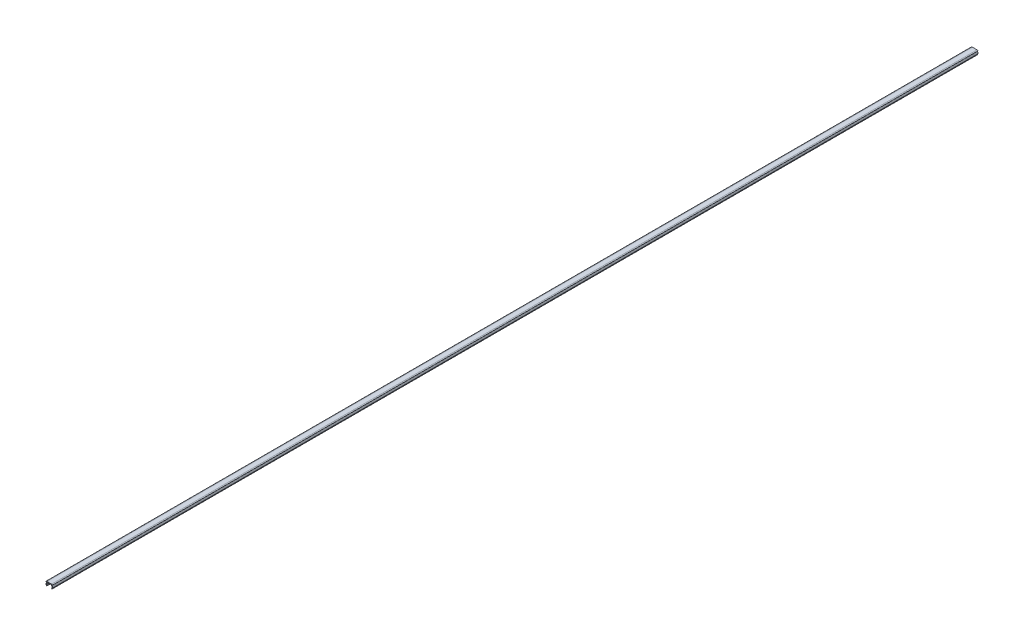
ISO-10303-21;
HEADER;
FILE_DESCRIPTION(('STEP AP214'),'2;1');
FILE_NAME('part.step','',(''),(''),'','','');
FILE_SCHEMA(('AUTOMOTIVE_DESIGN { 1 0 10303 214 1 1 1 1 }'));
ENDSEC;
DATA;
#1=APPLICATION_CONTEXT('core data for automotive mechanical design processes');
#2=APPLICATION_PROTOCOL_DEFINITION('international standard','automotive_design',2000,#1);
#3=PRODUCT_CONTEXT('',#1,'mechanical');
#4=PRODUCT('Part','Part','',(#3));
#5=PRODUCT_RELATED_PRODUCT_CATEGORY('part','',(#4));
#6=PRODUCT_DEFINITION_FORMATION('','',#4);
#7=PRODUCT_DEFINITION_CONTEXT('part definition',#1,'design');
#8=PRODUCT_DEFINITION('design','',#6,#7);
#9=PRODUCT_DEFINITION_SHAPE('','',#8);
#10=(LENGTH_UNIT() NAMED_UNIT(*) SI_UNIT(.MILLI.,.METRE.));
#11=(NAMED_UNIT(*) PLANE_ANGLE_UNIT() SI_UNIT($,.RADIAN.));
#12=(NAMED_UNIT(*) SI_UNIT($,.STERADIAN.) SOLID_ANGLE_UNIT());
#13=UNCERTAINTY_MEASURE_WITH_UNIT(LENGTH_MEASURE(1.E-05),#10,'distance_accuracy_value','');
#14=(GEOMETRIC_REPRESENTATION_CONTEXT(3) GLOBAL_UNCERTAINTY_ASSIGNED_CONTEXT((#13)) GLOBAL_UNIT_ASSIGNED_CONTEXT((#10,
#11,#12)) REPRESENTATION_CONTEXT('',''));
#15=CARTESIAN_POINT('',(0.,0.,0.));
#16=DIRECTION('',(0.,0.,1.));
#17=DIRECTION('',(1.,0.,0.));
#18=AXIS2_PLACEMENT_3D('',#15,#16,#17);
#19=CARTESIAN_POINT('',(0.,4.5,1000.));
#20=DIRECTION('',(0.,-1.,0.));
#21=DIRECTION('',(1.,0.,0.));
#22=AXIS2_PLACEMENT_3D('',#19,#20,#21);
#23=PLANE('',#22);
#24=DIRECTION('',(-1.,0.,0.));
#25=VECTOR('',#24,1.);
#26=CARTESIAN_POINT('',(0.,4.5,1000.));
#27=LINE('',#26,#25);
#28=CARTESIAN_POINT('',(2.55,4.5,1000.));
#29=VERTEX_POINT('',#28);
#30=CARTESIAN_POINT('',(-2.55,4.5,1000.));
#31=VERTEX_POINT('',#30);
#32=EDGE_CURVE('E347',#29,#31,#27,.T.);
#33=ORIENTED_EDGE('',*,*,#32,.F.);
#34=CARTESIAN_POINT('',(2.55,4.5,-50.));
#35=CARTESIAN_POINT('',(2.55,4.5,316.666666666667));
#36=CARTESIAN_POINT('',(2.55,4.5,683.333333333333));
#37=CARTESIAN_POINT('',(2.55,4.5,1050.));
#38=(BOUNDED_CURVE() B_SPLINE_CURVE(3,(#34,#35,#36,#37),.UNSPECIFIED.,.F.,
.F.) B_SPLINE_CURVE_WITH_KNOTS((4,4),(-1.05,0.05),
.UNSPECIFIED.) CURVE() GEOMETRIC_REPRESENTATION_ITEM() RATIONAL_B_SPLINE_CURVE((1.,1.,1.,1.)) REPRESENTATION_ITEM(''));
#39=CARTESIAN_POINT('',(2.55,4.5,0.));
#40=VERTEX_POINT('',#39);
#41=EDGE_CURVE('E313',#29,#40,#38,.F.);
#42=ORIENTED_EDGE('',*,*,#41,.T.);
#43=DIRECTION('',(-1.,0.,0.));
#44=VECTOR('',#43,1.);
#45=CARTESIAN_POINT('',(0.,4.5,0.));
#46=LINE('',#45,#44);
#47=CARTESIAN_POINT('',(-2.55,4.5,0.));
#48=VERTEX_POINT('',#47);
#49=EDGE_CURVE('E207',#40,#48,#46,.T.);
#50=ORIENTED_EDGE('',*,*,#49,.T.);
#51=CARTESIAN_POINT('',(-2.55,4.5,1050.));
#52=CARTESIAN_POINT('',(-2.55,4.5,683.333333333334));
#53=CARTESIAN_POINT('',(-2.55,4.5,316.666666666666));
#54=CARTESIAN_POINT('',(-2.55,4.5,-49.9999999999998));
#55=(BOUNDED_CURVE() B_SPLINE_CURVE(3,(#51,#52,#53,#54),.UNSPECIFIED.,.F.,
.F.) B_SPLINE_CURVE_WITH_KNOTS((4,4),(-0.05,1.05),
.UNSPECIFIED.) CURVE() GEOMETRIC_REPRESENTATION_ITEM() RATIONAL_B_SPLINE_CURVE((1.,1.,1.,1.)) REPRESENTATION_ITEM(''));
#56=EDGE_CURVE('E445',#48,#31,#55,.F.);
#57=ORIENTED_EDGE('',*,*,#56,.T.);
#58=EDGE_LOOP('',(#33,#42,#50,#57));
#59=FACE_BOUND('',#58,.T.);
#60=ADVANCED_FACE('F19',(#59),#23,.F.);
#61=CARTESIAN_POINT('',(-3.55,3.8,1000.));
#62=DIRECTION('',(1.,0.,0.));
#63=DIRECTION('',(0.,0.,-1.));
#64=AXIS2_PLACEMENT_3D('',#61,#62,#63);
#65=PLANE('',#64);
#66=DIRECTION('',(0.,-1.,0.));
#67=VECTOR('',#66,1.);
#68=CARTESIAN_POINT('',(-3.55,3.8,1000.));
#69=LINE('',#68,#67);
#70=CARTESIAN_POINT('',(-3.55,4.1,1000.));
#71=VERTEX_POINT('',#70);
#72=CARTESIAN_POINT('',(-3.55,4.,1000.));
#73=VERTEX_POINT('',#72);
#74=EDGE_CURVE('E361',#71,#73,#69,.T.);
#75=ORIENTED_EDGE('',*,*,#74,.F.);
#76=CARTESIAN_POINT('',(-3.55,4.1,-49.9999999999998));
#77=CARTESIAN_POINT('',(-3.55,4.1,316.666666666666));
#78=CARTESIAN_POINT('',(-3.55,4.1,683.333333333334));
#79=CARTESIAN_POINT('',(-3.55,4.1,1050.));
#80=(BOUNDED_CURVE() B_SPLINE_CURVE(3,(#76,#77,#78,#79),.UNSPECIFIED.,.F.,
.F.) B_SPLINE_CURVE_WITH_KNOTS((4,4),(-0.05,1.05),
.UNSPECIFIED.) CURVE() GEOMETRIC_REPRESENTATION_ITEM() RATIONAL_B_SPLINE_CURVE((1.,1.,1.,1.)) REPRESENTATION_ITEM(''));
#81=CARTESIAN_POINT('',(-3.55,4.1,0.));
#82=VERTEX_POINT('',#81);
#83=EDGE_CURVE('E434',#71,#82,#80,.F.);
#84=ORIENTED_EDGE('',*,*,#83,.T.);
#85=DIRECTION('',(0.,-1.,0.));
#86=VECTOR('',#85,1.);
#87=CARTESIAN_POINT('',(-3.55,3.8,0.));
#88=LINE('',#87,#86);
#89=CARTESIAN_POINT('',(-3.55,4.,0.));
#90=VERTEX_POINT('',#89);
#91=EDGE_CURVE('E346',#82,#90,#88,.T.);
#92=ORIENTED_EDGE('',*,*,#91,.T.);
#93=DIRECTION('',(0.,0.,-1.));
#94=VECTOR('',#93,1.);
#95=CARTESIAN_POINT('',(-3.55,4.,1000.));
#96=LINE('',#95,#94);
#97=EDGE_CURVE('E417',#90,#73,#96,.F.);
#98=ORIENTED_EDGE('',*,*,#97,.T.);
#99=EDGE_LOOP('',(#75,#84,#92,#98));
#100=FACE_BOUND('',#99,.T.);
#101=ADVANCED_FACE('F515',(#100),#65,.F.);
#102=CARTESIAN_POINT('',(-3.05,3.8,1000.));
#103=DIRECTION('',(0.,1.,0.));
#104=DIRECTION('',(0.,0.,1.));
#105=AXIS2_PLACEMENT_3D('',#102,#103,#104);
#106=PLANE('',#105);
#107=DIRECTION('',(1.,0.,0.));
#108=VECTOR('',#107,1.);
#109=CARTESIAN_POINT('',(-3.05,3.8,1000.));
#110=LINE('',#109,#108);
#111=CARTESIAN_POINT('',(-3.35,3.8,1000.));
#112=VERTEX_POINT('',#111);
#113=CARTESIAN_POINT('',(-3.05,3.8,1000.));
#114=VERTEX_POINT('',#113);
#115=EDGE_CURVE('E364',#112,#114,#110,.T.);
#116=ORIENTED_EDGE('',*,*,#115,.F.);
#117=DIRECTION('',(0.,0.,-1.));
#118=VECTOR('',#117,1.);
#119=CARTESIAN_POINT('',(-3.35,3.8,1000.));
#120=LINE('',#119,#118);
#121=CARTESIAN_POINT('',(-3.35,3.8,0.));
#122=VERTEX_POINT('',#121);
#123=EDGE_CURVE('E407',#112,#122,#120,.T.);
#124=ORIENTED_EDGE('',*,*,#123,.T.);
#125=DIRECTION('',(1.,0.,0.));
#126=VECTOR('',#125,1.);
#127=CARTESIAN_POINT('',(-3.05,3.8,0.));
#128=LINE('',#127,#126);
#129=CARTESIAN_POINT('',(-3.05,3.8,0.));
#130=VERTEX_POINT('',#129);
#131=EDGE_CURVE('E354',#122,#130,#128,.T.);
#132=ORIENTED_EDGE('',*,*,#131,.T.);
#133=DIRECTION('',(0.,0.,-1.));
#134=VECTOR('',#133,1.);
#135=CARTESIAN_POINT('',(-3.05,3.8,1000.));
#136=LINE('',#135,#134);
#137=EDGE_CURVE('E404',#114,#130,#136,.T.);
#138=ORIENTED_EDGE('',*,*,#137,.F.);
#139=EDGE_LOOP('',(#116,#124,#132,#138));
#140=FACE_BOUND('',#139,.T.);
#141=ADVANCED_FACE('F646',(#140),#106,.F.);
#142=CARTESIAN_POINT('',(-3.05,3.8,1000.));
#143=DIRECTION('',(0.98058067569092,-0.196116135138184,0.));
#144=DIRECTION('',(0.196116135138184,0.98058067569092,0.));
#145=AXIS2_PLACEMENT_3D('',#142,#143,#144);
#146=PLANE('',#145);
#147=DIRECTION('',(-0.196116135138184,-0.98058067569092,0.));
#148=VECTOR('',#147,1.);
#149=CARTESIAN_POINT('',(-3.05,3.8,0.));
#150=LINE('',#149,#148);
#151=CARTESIAN_POINT('',(-3.53587463657409,1.37062681712956,0.));
#152=VERTEX_POINT('',#151);
#153=EDGE_CURVE('E640',#130,#152,#150,.T.);
#154=ORIENTED_EDGE('',*,*,#153,.T.);
#155=DIRECTION('',(0.,0.,-1.));
#156=VECTOR('',#155,1.);
#157=CARTESIAN_POINT('',(-3.53587463657409,1.37062681712956,1000.));
#158=LINE('',#157,#156);
#159=CARTESIAN_POINT('',(-3.53587463657409,1.37062681712956,1000.));
#160=VERTEX_POINT('',#159);
#161=EDGE_CURVE('E359',#152,#160,#158,.F.);
#162=ORIENTED_EDGE('',*,*,#161,.T.);
#163=DIRECTION('',(-0.196116135138184,-0.98058067569092,0.));
#164=VECTOR('',#163,1.);
#165=CARTESIAN_POINT('',(-3.05,3.8,1000.));
#166=LINE('',#165,#164);
#167=EDGE_CURVE('E371',#114,#160,#166,.T.);
#168=ORIENTED_EDGE('',*,*,#167,.F.);
#169=ORIENTED_EDGE('',*,*,#137,.T.);
#170=EDGE_LOOP('',(#154,#162,#168,#169));
#171=FACE_BOUND('',#170,.T.);
#172=ADVANCED_FACE('F648',(#171),#146,.F.);
#173=CARTESIAN_POINT('',(-3.55,1.3,1000.));
#174=DIRECTION('',(0.880471099922175,0.474099823035018,0.));
#175=DIRECTION('',(-0.474099823035018,0.880471099922175,0.));
#176=AXIS2_PLACEMENT_3D('',#173,#174,#175);
#177=PLANE('',#176);
#178=DIRECTION('',(0.474099823035018,-0.880471099922175,0.));
#179=VECTOR('',#178,1.);
#180=CARTESIAN_POINT('',(-3.55,1.3,1000.));
#181=LINE('',#180,#179);
#182=CARTESIAN_POINT('',(-3.51585272142034,1.23658362549492,1000.));
#183=VERTEX_POINT('',#182);
#184=CARTESIAN_POINT('',(-2.85,0.,1000.));
#185=VERTEX_POINT('',#184);
#186=EDGE_CURVE('E374',#183,#185,#181,.T.);
#187=ORIENTED_EDGE('',*,*,#186,.F.);
#188=DIRECTION('',(0.,0.,-1.));
#189=VECTOR('',#188,1.);
#190=CARTESIAN_POINT('',(-3.51585272142034,1.23658362549492,1000.));
#191=LINE('',#190,#189);
#192=CARTESIAN_POINT('',(-3.51585272142034,1.23658362549492,0.));
#193=VERTEX_POINT('',#192);
#194=EDGE_CURVE('E428',#183,#193,#191,.T.);
#195=ORIENTED_EDGE('',*,*,#194,.T.);
#196=DIRECTION('',(0.474099823035018,-0.880471099922175,0.));
#197=VECTOR('',#196,1.);
#198=CARTESIAN_POINT('',(-3.55,1.3,0.));
#199=LINE('',#198,#197);
#200=CARTESIAN_POINT('',(-2.85,0.,0.));
#201=VERTEX_POINT('',#200);
#202=EDGE_CURVE('E639',#193,#201,#199,.T.);
#203=ORIENTED_EDGE('',*,*,#202,.T.);
#204=DIRECTION('',(0.,0.,-1.));
#205=VECTOR('',#204,1.);
#206=CARTESIAN_POINT('',(-2.85,0.,1000.));
#207=LINE('',#206,#205);
#208=EDGE_CURVE('E394',#185,#201,#207,.T.);
#209=ORIENTED_EDGE('',*,*,#208,.F.);
#210=EDGE_LOOP('',(#187,#195,#203,#209));
#211=FACE_BOUND('',#210,.T.);
#212=ADVANCED_FACE('F652',(#211),#177,.F.);
#213=CARTESIAN_POINT('',(-2.55,0.4,1000.));
#214=DIRECTION('',(-0.8,0.6,0.));
#215=DIRECTION('',(-0.6,-0.8,0.));
#216=AXIS2_PLACEMENT_3D('',#213,#214,#215);
#217=PLANE('',#216);
#218=DIRECTION('',(0.6,0.8,0.));
#219=VECTOR('',#218,1.);
#220=CARTESIAN_POINT('',(-2.55,0.4,0.));
#221=LINE('',#220,#219);
#222=CARTESIAN_POINT('',(-2.61548888906306,0.312681481249256,0.));
#223=VERTEX_POINT('',#222);
#224=EDGE_CURVE('E634',#201,#223,#221,.T.);
#225=ORIENTED_EDGE('',*,*,#224,.T.);
#226=DIRECTION('',(0.,0.,-1.));
#227=VECTOR('',#226,1.);
#228=CARTESIAN_POINT('',(-2.61548888906306,0.312681481249256,1000.));
#229=LINE('',#228,#227);
#230=CARTESIAN_POINT('',(-2.61548888906306,0.312681481249256,1000.));
#231=VERTEX_POINT('',#230);
#232=EDGE_CURVE('E427',#223,#231,#229,.F.);
#233=ORIENTED_EDGE('',*,*,#232,.T.);
#234=DIRECTION('',(0.6,0.8,0.));
#235=VECTOR('',#234,1.);
#236=CARTESIAN_POINT('',(-2.55,0.4,1000.));
#237=LINE('',#236,#235);
#238=EDGE_CURVE('E376',#185,#231,#237,.T.);
#239=ORIENTED_EDGE('',*,*,#238,.F.);
#240=ORIENTED_EDGE('',*,*,#208,.T.);
#241=EDGE_LOOP('',(#225,#233,#239,#240));
#242=FACE_BOUND('',#241,.T.);
#243=ADVANCED_FACE('F655',(#242),#217,.F.);
#244=CARTESIAN_POINT('',(-2.91927550430771,1.39421077030576,1000.));
#245=DIRECTION('',(-0.937426128125724,-0.348184224667365,0.));
#246=DIRECTION('',(0.348184224667365,-0.937426128125724,0.));
#247=AXIS2_PLACEMENT_3D('',#244,#245,#246);
#248=PLANE('',#247);
#249=DIRECTION('',(-0.348184224667365,0.937426128125724,0.));
#250=VECTOR('',#249,1.);
#251=CARTESIAN_POINT('',(-2.91927550430771,1.39421077030576,1000.));
#252=LINE('',#251,#250);
#253=CARTESIAN_POINT('',(-2.58800366343791,0.502318326182729,1000.));
#254=VERTEX_POINT('',#253);
#255=CARTESIAN_POINT('',(-2.91927550430771,1.39421077030576,1000.));
#256=VERTEX_POINT('',#255);
#257=EDGE_CURVE('E379',#254,#256,#252,.T.);
#258=ORIENTED_EDGE('',*,*,#257,.F.);
#259=DIRECTION('',(0.,0.,-1.));
#260=VECTOR('',#259,1.);
#261=CARTESIAN_POINT('',(-2.58800366343791,0.502318326182729,1000.));
#262=LINE('',#261,#260);
#263=CARTESIAN_POINT('',(-2.58800366343791,0.502318326182729,0.));
#264=VERTEX_POINT('',#263);
#265=EDGE_CURVE('E425',#254,#264,#262,.T.);
#266=ORIENTED_EDGE('',*,*,#265,.T.);
#267=DIRECTION('',(-0.348184224667365,0.937426128125724,0.));
#268=VECTOR('',#267,1.);
#269=CARTESIAN_POINT('',(-2.91927550430771,1.39421077030576,0.));
#270=LINE('',#269,#268);
#271=CARTESIAN_POINT('',(-2.91927550430771,1.39421077030576,0.));
#272=VERTEX_POINT('',#271);
#273=EDGE_CURVE('E391',#264,#272,#270,.T.);
#274=ORIENTED_EDGE('',*,*,#273,.T.);
#275=DIRECTION('',(0.,0.,-1.));
#276=VECTOR('',#275,1.);
#277=CARTESIAN_POINT('',(-2.91927550430771,1.39421077030576,1000.));
#278=LINE('',#277,#276);
#279=EDGE_CURVE('E388',#256,#272,#278,.T.);
#280=ORIENTED_EDGE('',*,*,#279,.F.);
#281=EDGE_LOOP('',(#258,#266,#274,#280));
#282=FACE_BOUND('',#281,.T.);
#283=ADVANCED_FACE('F389',(#282),#248,.F.);
#284=CARTESIAN_POINT('',(-2.43811765836887,3.8,1000.));
#285=DIRECTION('',(-0.98058067569092,0.196116135138184,0.));
#286=DIRECTION('',(-0.196116135138184,-0.98058067569092,0.));
#287=AXIS2_PLACEMENT_3D('',#284,#285,#286);
#288=PLANE('',#287);
#289=DIRECTION('',(0.196116135138184,0.98058067569092,0.));
#290=VECTOR('',#289,1.);
#291=CARTESIAN_POINT('',(-2.43811765836887,3.8,0.));
#292=LINE('',#291,#290);
#293=CARTESIAN_POINT('',(-2.43811765836887,3.8,0.));
#294=VERTEX_POINT('',#293);
#295=EDGE_CURVE('E397',#272,#294,#292,.T.);
#296=ORIENTED_EDGE('',*,*,#295,.T.);
#297=DIRECTION('',(0.,0.,-1.));
#298=VECTOR('',#297,1.);
#299=CARTESIAN_POINT('',(-2.43811765836887,3.8,1000.));
#300=LINE('',#299,#298);
#301=CARTESIAN_POINT('',(-2.43811765836887,3.8,1000.));
#302=VERTEX_POINT('',#301);
#303=EDGE_CURVE('E197',#302,#294,#300,.T.);
#304=ORIENTED_EDGE('',*,*,#303,.F.);
#305=DIRECTION('',(0.196116135138184,0.98058067569092,0.));
#306=VECTOR('',#305,1.);
#307=CARTESIAN_POINT('',(-2.43811765836887,3.8,1000.));
#308=LINE('',#307,#306);
#309=EDGE_CURVE('E193',#256,#302,#308,.T.);
#310=ORIENTED_EDGE('',*,*,#309,.F.);
#311=ORIENTED_EDGE('',*,*,#279,.T.);
#312=EDGE_LOOP('',(#296,#304,#310,#311));
#313=FACE_BOUND('',#312,.T.);
#314=ADVANCED_FACE('F396',(#313),#288,.F.);
#315=CARTESIAN_POINT('',(0.,3.8,1000.));
#316=DIRECTION('',(0.,1.,0.));
#317=DIRECTION('',(-1.,0.,0.));
#318=AXIS2_PLACEMENT_3D('',#315,#316,#317);
#319=PLANE('',#318);
#320=DIRECTION('',(1.,0.,0.));
#321=VECTOR('',#320,1.);
#322=CARTESIAN_POINT('',(0.,3.8,0.));
#323=LINE('',#322,#321);
#324=CARTESIAN_POINT('',(2.43811765836886,3.8,0.));
#325=VERTEX_POINT('',#324);
#326=EDGE_CURVE('E203',#294,#325,#323,.T.);
#327=ORIENTED_EDGE('',*,*,#326,.T.);
#328=DIRECTION('',(0.,0.,-1.));
#329=VECTOR('',#328,1.);
#330=CARTESIAN_POINT('',(2.43811765836886,3.8,1000.));
#331=LINE('',#330,#329);
#332=CARTESIAN_POINT('',(2.43811765836886,3.8,1000.));
#333=VERTEX_POINT('',#332);
#334=EDGE_CURVE('E200',#333,#325,#331,.T.);
#335=ORIENTED_EDGE('',*,*,#334,.F.);
#336=DIRECTION('',(1.,0.,0.));
#337=VECTOR('',#336,1.);
#338=CARTESIAN_POINT('',(0.,3.8,1000.));
#339=LINE('',#338,#337);
#340=EDGE_CURVE('E186',#302,#333,#339,.T.);
#341=ORIENTED_EDGE('',*,*,#340,.F.);
#342=ORIENTED_EDGE('',*,*,#303,.T.);
#343=EDGE_LOOP('',(#327,#335,#341,#342));
#344=FACE_BOUND('',#343,.T.);
#345=ADVANCED_FACE('F201',(#344),#319,.F.);
#346=CARTESIAN_POINT('',(0.,0.,1000.));
#347=DIRECTION('',(0.,0.,1.));
#348=DIRECTION('',(1.,0.,0.));
#349=AXIS2_PLACEMENT_3D('',#346,#347,#348);
#350=PLANE('',#349);
#351=DIRECTION('',(0.,-1.,0.));
#352=VECTOR('',#351,1.);
#353=CARTESIAN_POINT('',(3.55,3.8,1000.));
#354=LINE('',#353,#352);
#355=CARTESIAN_POINT('',(3.55,4.1,1000.));
#356=VERTEX_POINT('',#355);
#357=CARTESIAN_POINT('',(3.55,4.,1000.));
#358=VERTEX_POINT('',#357);
#359=EDGE_CURVE('E230',#356,#358,#354,.T.);
#360=ORIENTED_EDGE('',*,*,#359,.F.);
#361=CARTESIAN_POINT('',(2.55,4.5,1000.));
#362=CARTESIAN_POINT('',(3.55,4.5,1000.));
#363=CARTESIAN_POINT('',(3.55,4.1,1000.));
#364=(BOUNDED_CURVE() B_SPLINE_CURVE(2,(#361,#362,#363),.UNSPECIFIED.,.F.,
.F.) B_SPLINE_CURVE_WITH_KNOTS((3,3),(0.,1.),
.UNSPECIFIED.) CURVE() GEOMETRIC_REPRESENTATION_ITEM() RATIONAL_B_SPLINE_CURVE((1.,
0.707106781186548,1.)) REPRESENTATION_ITEM(''));
#365=EDGE_CURVE('E10',#356,#29,#364,.F.);
#366=ORIENTED_EDGE('',*,*,#365,.T.);
#367=ORIENTED_EDGE('',*,*,#32,.T.);
#368=CARTESIAN_POINT('',(-3.55,4.1,1000.));
#369=CARTESIAN_POINT('',(-3.55,4.5,1000.));
#370=CARTESIAN_POINT('',(-2.55,4.5,1000.));
#371=(BOUNDED_CURVE() B_SPLINE_CURVE(2,(#368,#369,#370),.UNSPECIFIED.,.F.,
.F.) B_SPLINE_CURVE_WITH_KNOTS((3,3),(0.,1.),
.UNSPECIFIED.) CURVE() GEOMETRIC_REPRESENTATION_ITEM() RATIONAL_B_SPLINE_CURVE((1.,
0.707106781186547,1.)) REPRESENTATION_ITEM(''));
#372=EDGE_CURVE('E449',#31,#71,#371,.F.);
#373=ORIENTED_EDGE('',*,*,#372,.T.);
#374=ORIENTED_EDGE('',*,*,#74,.T.);
#375=CARTESIAN_POINT('',(-3.35,4.,1000.));
#376=DIRECTION('',(0.,0.,1.));
#377=DIRECTION('',(1.,0.,0.));
#378=AXIS2_PLACEMENT_3D('',#375,#376,#377);
#379=CIRCLE('',#378,0.2);
#380=EDGE_CURVE('E423',#73,#112,#379,.T.);
#381=ORIENTED_EDGE('',*,*,#380,.T.);
#382=ORIENTED_EDGE('',*,*,#115,.T.);
#383=ORIENTED_EDGE('',*,*,#167,.T.);
#384=CARTESIAN_POINT('',(-3.3397585014359,1.33140359010192,1000.));
#385=DIRECTION('',(0.,0.,1.));
#386=DIRECTION('',(1.,0.,0.));
#387=AXIS2_PLACEMENT_3D('',#384,#385,#386);
#388=CIRCLE('',#387,0.2);
#389=EDGE_CURVE('E420',#160,#183,#388,.T.);
#390=ORIENTED_EDGE('',*,*,#389,.T.);
#391=ORIENTED_EDGE('',*,*,#186,.T.);
#392=ORIENTED_EDGE('',*,*,#238,.T.);
#393=CARTESIAN_POINT('',(-2.77548888906306,0.432681481249256,1000.));
#394=DIRECTION('',(0.,0.,1.));
#395=DIRECTION('',(1.,0.,0.));
#396=AXIS2_PLACEMENT_3D('',#393,#394,#395);
#397=CIRCLE('',#396,0.2);
#398=EDGE_CURVE('E383',#231,#254,#397,.T.);
#399=ORIENTED_EDGE('',*,*,#398,.T.);
#400=ORIENTED_EDGE('',*,*,#257,.T.);
#401=ORIENTED_EDGE('',*,*,#309,.T.);
#402=ORIENTED_EDGE('',*,*,#340,.T.);
#403=DIRECTION('',(-0.196116135138184,0.98058067569092,0.));
#404=VECTOR('',#403,1.);
#405=CARTESIAN_POINT('',(2.43811765836886,3.8,1000.));
#406=LINE('',#405,#404);
#407=CARTESIAN_POINT('',(2.91927550430771,1.39421077030576,1000.));
#408=VERTEX_POINT('',#407);
#409=EDGE_CURVE('E191',#408,#333,#406,.T.);
#410=ORIENTED_EDGE('',*,*,#409,.F.);
#411=DIRECTION('',(0.348184224667364,0.937426128125724,0.));
#412=VECTOR('',#411,1.);
#413=CARTESIAN_POINT('',(2.91927550430771,1.39421077030576,1000.));
#414=LINE('',#413,#412);
#415=CARTESIAN_POINT('',(2.58800366343791,0.50231832618273,1000.));
#416=VERTEX_POINT('',#415);
#417=EDGE_CURVE('E213',#416,#408,#414,.T.);
#418=ORIENTED_EDGE('',*,*,#417,.F.);
#419=CARTESIAN_POINT('',(2.77548888906306,0.432681481249257,1000.));
#420=DIRECTION('',(0.,0.,1.));
#421=DIRECTION('',(1.,0.,0.));
#422=AXIS2_PLACEMENT_3D('',#419,#420,#421);
#423=CIRCLE('',#422,0.2);
#424=CARTESIAN_POINT('',(2.61548888906306,0.312681481249257,1000.));
#425=VERTEX_POINT('',#424);
#426=EDGE_CURVE('E471',#416,#425,#423,.T.);
#427=ORIENTED_EDGE('',*,*,#426,.T.);
#428=DIRECTION('',(-0.6,0.8,0.));
#429=VECTOR('',#428,1.);
#430=CARTESIAN_POINT('',(2.55,0.400000000000001,1000.));
#431=LINE('',#430,#429);
#432=CARTESIAN_POINT('',(2.85,0.,1000.));
#433=VERTEX_POINT('',#432);
#434=EDGE_CURVE('E216',#433,#425,#431,.T.);
#435=ORIENTED_EDGE('',*,*,#434,.F.);
#436=DIRECTION('',(-0.474099823035017,-0.880471099922175,0.));
#437=VECTOR('',#436,1.);
#438=CARTESIAN_POINT('',(3.55,1.3,1000.));
#439=LINE('',#438,#437);
#440=CARTESIAN_POINT('',(3.51585272142034,1.23658362549492,1000.));
#441=VERTEX_POINT('',#440);
#442=EDGE_CURVE('E223',#441,#433,#439,.T.);
#443=ORIENTED_EDGE('',*,*,#442,.F.);
#444=CARTESIAN_POINT('',(3.3397585014359,1.33140359010192,1000.));
#445=DIRECTION('',(0.,0.,1.));
#446=DIRECTION('',(1.,0.,0.));
#447=AXIS2_PLACEMENT_3D('',#444,#445,#446);
#448=CIRCLE('',#447,0.2);
#449=CARTESIAN_POINT('',(3.53587463657409,1.37062681712956,1000.));
#450=VERTEX_POINT('',#449);
#451=EDGE_CURVE('E469',#441,#450,#448,.T.);
#452=ORIENTED_EDGE('',*,*,#451,.T.);
#453=DIRECTION('',(0.196116135138184,-0.98058067569092,0.));
#454=VECTOR('',#453,1.);
#455=CARTESIAN_POINT('',(3.05,3.8,1000.));
#456=LINE('',#455,#454);
#457=CARTESIAN_POINT('',(3.05,3.8,1000.));
#458=VERTEX_POINT('',#457);
#459=EDGE_CURVE('E225',#458,#450,#456,.T.);
#460=ORIENTED_EDGE('',*,*,#459,.F.);
#461=DIRECTION('',(-1.,0.,0.));
#462=VECTOR('',#461,1.);
#463=CARTESIAN_POINT('',(3.05,3.8,1000.));
#464=LINE('',#463,#462);
#465=CARTESIAN_POINT('',(3.35,3.8,1000.));
#466=VERTEX_POINT('',#465);
#467=EDGE_CURVE('E228',#466,#458,#464,.T.);
#468=ORIENTED_EDGE('',*,*,#467,.F.);
#469=CARTESIAN_POINT('',(3.35,4.,1000.));
#470=DIRECTION('',(0.,0.,1.));
#471=DIRECTION('',(1.,0.,0.));
#472=AXIS2_PLACEMENT_3D('',#469,#470,#471);
#473=CIRCLE('',#472,0.2);
#474=EDGE_CURVE('E473',#466,#358,#473,.T.);
#475=ORIENTED_EDGE('',*,*,#474,.T.);
#476=EDGE_LOOP('',(#360,#366,#367,#373,#374,#381,#382,#383,#390,#391,#392,#399,#400,#401,#402,
#410,#418,#427,#435,#443,#452,#460,#468,#475));
#477=FACE_BOUND('',#476,.T.);
#478=ADVANCED_FACE('F188',(#477),#350,.T.);
#479=CARTESIAN_POINT('',(0.,0.,0.));
#480=DIRECTION('',(0.,0.,1.));
#481=DIRECTION('',(1.,0.,0.));
#482=AXIS2_PLACEMENT_3D('',#479,#480,#481);
#483=PLANE('',#482);
#484=ORIENTED_EDGE('',*,*,#49,.F.);
#485=CARTESIAN_POINT('',(3.55,4.1,0.));
#486=CARTESIAN_POINT('',(3.55,4.5,0.));
#487=CARTESIAN_POINT('',(2.55,4.5,0.));
#488=(BOUNDED_CURVE() B_SPLINE_CURVE(2,(#485,#486,#487),.UNSPECIFIED.,.F.,
.F.) B_SPLINE_CURVE_WITH_KNOTS((3,3),(0.,1.),
.UNSPECIFIED.) CURVE() GEOMETRIC_REPRESENTATION_ITEM() RATIONAL_B_SPLINE_CURVE((1.,
0.707106781186548,1.)) REPRESENTATION_ITEM(''));
#489=CARTESIAN_POINT('',(3.55,4.1,0.));
#490=VERTEX_POINT('',#489);
#491=EDGE_CURVE('E48',#40,#490,#488,.F.);
#492=ORIENTED_EDGE('',*,*,#491,.T.);
#493=DIRECTION('',(0.,-1.,0.));
#494=VECTOR('',#493,1.);
#495=CARTESIAN_POINT('',(3.55,3.8,0.));
#496=LINE('',#495,#494);
#497=CARTESIAN_POINT('',(3.55,4.,0.));
#498=VERTEX_POINT('',#497);
#499=EDGE_CURVE('E214',#490,#498,#496,.T.);
#500=ORIENTED_EDGE('',*,*,#499,.T.);
#501=CARTESIAN_POINT('',(3.35,4.,0.));
#502=DIRECTION('',(0.,0.,1.));
#503=DIRECTION('',(1.,0.,0.));
#504=AXIS2_PLACEMENT_3D('',#501,#502,#503);
#505=CIRCLE('',#504,0.2);
#506=CARTESIAN_POINT('',(3.35,3.8,0.));
#507=VERTEX_POINT('',#506);
#508=EDGE_CURVE('E465',#498,#507,#505,.F.);
#509=ORIENTED_EDGE('',*,*,#508,.T.);
#510=DIRECTION('',(-1.,0.,0.));
#511=VECTOR('',#510,1.);
#512=CARTESIAN_POINT('',(3.05,3.8,0.));
#513=LINE('',#512,#511);
#514=CARTESIAN_POINT('',(3.05,3.8,0.));
#515=VERTEX_POINT('',#514);
#516=EDGE_CURVE('E218',#507,#515,#513,.T.);
#517=ORIENTED_EDGE('',*,*,#516,.T.);
#518=DIRECTION('',(0.196116135138184,-0.98058067569092,0.));
#519=VECTOR('',#518,1.);
#520=CARTESIAN_POINT('',(3.05,3.8,0.));
#521=LINE('',#520,#519);
#522=CARTESIAN_POINT('',(3.53587463657409,1.37062681712956,0.));
#523=VERTEX_POINT('',#522);
#524=EDGE_CURVE('E493',#515,#523,#521,.T.);
#525=ORIENTED_EDGE('',*,*,#524,.T.);
#526=CARTESIAN_POINT('',(3.3397585014359,1.33140359010192,0.));
#527=DIRECTION('',(0.,0.,1.));
#528=DIRECTION('',(1.,0.,0.));
#529=AXIS2_PLACEMENT_3D('',#526,#527,#528);
#530=CIRCLE('',#529,0.2);
#531=CARTESIAN_POINT('',(3.51585272142034,1.23658362549492,0.));
#532=VERTEX_POINT('',#531);
#533=EDGE_CURVE('E454',#523,#532,#530,.F.);
#534=ORIENTED_EDGE('',*,*,#533,.T.);
#535=DIRECTION('',(-0.474099823035017,-0.880471099922175,0.));
#536=VECTOR('',#535,1.);
#537=CARTESIAN_POINT('',(3.55,1.3,0.));
#538=LINE('',#537,#536);
#539=CARTESIAN_POINT('',(2.85,0.,0.));
#540=VERTEX_POINT('',#539);
#541=EDGE_CURVE('E490',#532,#540,#538,.T.);
#542=ORIENTED_EDGE('',*,*,#541,.T.);
#543=DIRECTION('',(-0.6,0.8,0.));
#544=VECTOR('',#543,1.);
#545=CARTESIAN_POINT('',(2.55,0.400000000000001,0.));
#546=LINE('',#545,#544);
#547=CARTESIAN_POINT('',(2.61548888906306,0.312681481249257,0.));
#548=VERTEX_POINT('',#547);
#549=EDGE_CURVE('E489',#540,#548,#546,.T.);
#550=ORIENTED_EDGE('',*,*,#549,.T.);
#551=CARTESIAN_POINT('',(2.77548888906306,0.432681481249257,0.));
#552=DIRECTION('',(0.,0.,1.));
#553=DIRECTION('',(1.,0.,0.));
#554=AXIS2_PLACEMENT_3D('',#551,#552,#553);
#555=CIRCLE('',#554,0.2);
#556=CARTESIAN_POINT('',(2.58800366343791,0.50231832618273,0.));
#557=VERTEX_POINT('',#556);
#558=EDGE_CURVE('E457',#548,#557,#555,.F.);
#559=ORIENTED_EDGE('',*,*,#558,.T.);
#560=DIRECTION('',(0.348184224667364,0.937426128125724,0.));
#561=VECTOR('',#560,1.);
#562=CARTESIAN_POINT('',(2.91927550430771,1.39421077030576,0.));
#563=LINE('',#562,#561);
#564=CARTESIAN_POINT('',(2.91927550430771,1.39421077030576,0.));
#565=VERTEX_POINT('',#564);
#566=EDGE_CURVE('E480',#557,#565,#563,.T.);
#567=ORIENTED_EDGE('',*,*,#566,.T.);
#568=DIRECTION('',(-0.196116135138184,0.98058067569092,0.));
#569=VECTOR('',#568,1.);
#570=CARTESIAN_POINT('',(2.43811765836886,3.8,0.));
#571=LINE('',#570,#569);
#572=EDGE_CURVE('E233',#565,#325,#571,.T.);
#573=ORIENTED_EDGE('',*,*,#572,.T.);
#574=ORIENTED_EDGE('',*,*,#326,.F.);
#575=ORIENTED_EDGE('',*,*,#295,.F.);
#576=ORIENTED_EDGE('',*,*,#273,.F.);
#577=CARTESIAN_POINT('',(-2.77548888906306,0.432681481249256,0.));
#578=DIRECTION('',(0.,0.,1.));
#579=DIRECTION('',(1.,0.,0.));
#580=AXIS2_PLACEMENT_3D('',#577,#578,#579);
#581=CIRCLE('',#580,0.2);
#582=EDGE_CURVE('E412',#264,#223,#581,.F.);
#583=ORIENTED_EDGE('',*,*,#582,.T.);
#584=ORIENTED_EDGE('',*,*,#224,.F.);
#585=ORIENTED_EDGE('',*,*,#202,.F.);
#586=CARTESIAN_POINT('',(-3.3397585014359,1.33140359010192,0.));
#587=DIRECTION('',(0.,0.,1.));
#588=DIRECTION('',(1.,0.,0.));
#589=AXIS2_PLACEMENT_3D('',#586,#587,#588);
#590=CIRCLE('',#589,0.2);
#591=EDGE_CURVE('E410',#193,#152,#590,.F.);
#592=ORIENTED_EDGE('',*,*,#591,.T.);
#593=ORIENTED_EDGE('',*,*,#153,.F.);
#594=ORIENTED_EDGE('',*,*,#131,.F.);
#595=CARTESIAN_POINT('',(-3.35,4.,0.));
#596=DIRECTION('',(0.,0.,1.));
#597=DIRECTION('',(1.,0.,0.));
#598=AXIS2_PLACEMENT_3D('',#595,#596,#597);
#599=CIRCLE('',#598,0.2);
#600=EDGE_CURVE('E414',#122,#90,#599,.F.);
#601=ORIENTED_EDGE('',*,*,#600,.T.);
#602=ORIENTED_EDGE('',*,*,#91,.F.);
#603=CARTESIAN_POINT('',(-2.55,4.5,1.97758476261356E-13));
#604=CARTESIAN_POINT('',(-3.55,4.5,2.08527904668939E-13));
#605=CARTESIAN_POINT('',(-3.55,4.1,1.97758476261356E-13));
#606=(BOUNDED_CURVE() B_SPLINE_CURVE(2,(#603,#604,#605),.UNSPECIFIED.,.F.,
.F.) B_SPLINE_CURVE_WITH_KNOTS((3,3),(0.,1.),
.UNSPECIFIED.) CURVE() GEOMETRIC_REPRESENTATION_ITEM() RATIONAL_B_SPLINE_CURVE((1.,
0.707106781186548,1.)) REPRESENTATION_ITEM(''));
#607=EDGE_CURVE('E439',#82,#48,#606,.F.);
#608=ORIENTED_EDGE('',*,*,#607,.T.);
#609=EDGE_LOOP('',(#484,#492,#500,#509,#517,#525,#534,#542,#550,#559,#567,#573,#574,#575,#576,
#583,#584,#585,#592,#593,#594,#601,#602,#608));
#610=FACE_BOUND('',#609,.T.);
#611=ADVANCED_FACE('F282',(#610),#483,.F.);
#612=CARTESIAN_POINT('',(-3.35,4.,1000.));
#613=DIRECTION('',(0.,0.,-1.));
#614=DIRECTION('',(-1.,0.,0.));
#615=AXIS2_PLACEMENT_3D('',#612,#613,#614);
#616=CYLINDRICAL_SURFACE('',#615,0.2);
#617=ORIENTED_EDGE('',*,*,#380,.F.);
#618=ORIENTED_EDGE('',*,*,#97,.F.);
#619=ORIENTED_EDGE('',*,*,#600,.F.);
#620=ORIENTED_EDGE('',*,*,#123,.F.);
#621=EDGE_LOOP('',(#617,#618,#619,#620));
#622=FACE_BOUND('',#621,.T.);
#623=ADVANCED_FACE('F518',(#622),#616,.T.);
#624=CARTESIAN_POINT('',(-2.77548888906306,0.432681481249256,1000.));
#625=DIRECTION('',(0.,0.,-1.));
#626=DIRECTION('',(-1.,0.,0.));
#627=AXIS2_PLACEMENT_3D('',#624,#625,#626);
#628=CYLINDRICAL_SURFACE('',#627,0.2);
#629=ORIENTED_EDGE('',*,*,#398,.F.);
#630=ORIENTED_EDGE('',*,*,#232,.F.);
#631=ORIENTED_EDGE('',*,*,#582,.F.);
#632=ORIENTED_EDGE('',*,*,#265,.F.);
#633=EDGE_LOOP('',(#629,#630,#631,#632));
#634=FACE_BOUND('',#633,.T.);
#635=ADVANCED_FACE('F545',(#634),#628,.T.);
#636=CARTESIAN_POINT('',(-3.3397585014359,1.33140359010192,1000.));
#637=DIRECTION('',(0.,0.,-1.));
#638=DIRECTION('',(-1.,0.,0.));
#639=AXIS2_PLACEMENT_3D('',#636,#637,#638);
#640=CYLINDRICAL_SURFACE('',#639,0.2);
#641=ORIENTED_EDGE('',*,*,#389,.F.);
#642=ORIENTED_EDGE('',*,*,#161,.F.);
#643=ORIENTED_EDGE('',*,*,#591,.F.);
#644=ORIENTED_EDGE('',*,*,#194,.F.);
#645=EDGE_LOOP('',(#641,#642,#643,#644));
#646=FACE_BOUND('',#645,.T.);
#647=ADVANCED_FACE('F549',(#646),#640,.T.);
#648=CARTESIAN_POINT('',(-3.55,4.1,1050.));
#649=CARTESIAN_POINT('',(-3.55,4.1,683.333333333334));
#650=CARTESIAN_POINT('',(-3.55,4.1,316.666666666666));
#651=CARTESIAN_POINT('',(-3.55,4.1,-49.9999999999998));
#652=CARTESIAN_POINT('',(-3.55,4.5,1050.));
#653=CARTESIAN_POINT('',(-3.55,4.5,683.333333333334));
#654=CARTESIAN_POINT('',(-3.55,4.5,316.666666666666));
#655=CARTESIAN_POINT('',(-3.55,4.5,-49.9999999999998));
#656=CARTESIAN_POINT('',(-2.55,4.5,1050.));
#657=CARTESIAN_POINT('',(-2.55,4.5,683.333333333334));
#658=CARTESIAN_POINT('',(-2.55,4.5,316.666666666666));
#659=CARTESIAN_POINT('',(-2.55,4.5,-49.9999999999998));
#660=(BOUNDED_SURFACE() B_SPLINE_SURFACE(2,3,((#648,#649,#650,#651),(#652,#653,#654,#655),(#656,
#657,#658,#659)),.UNSPECIFIED.,.F.,.F.,.F.) B_SPLINE_SURFACE_WITH_KNOTS((3,3),(4,4),(0.,1.),
(-0.05,1.05),.UNSPECIFIED.) GEOMETRIC_REPRESENTATION_ITEM() RATIONAL_B_SPLINE_SURFACE(((1.,1.,
1.,1.),(0.707106781186548,0.707106781186548,0.707106781186548,0.707106781186548),(1.,1.,1.,1.))) REPRESENTATION_ITEM('') SURFACE());
#661=ORIENTED_EDGE('',*,*,#372,.F.);
#662=ORIENTED_EDGE('',*,*,#56,.F.);
#663=ORIENTED_EDGE('',*,*,#607,.F.);
#664=ORIENTED_EDGE('',*,*,#83,.F.);
#665=EDGE_LOOP('',(#661,#662,#663,#664));
#666=FACE_BOUND('',#665,.T.);
#667=ADVANCED_FACE('F279',(#666),#660,.T.);
#668=CARTESIAN_POINT('',(2.43811765836886,3.8,1000.));
#669=DIRECTION('',(-0.98058067569092,-0.196116135138184,0.));
#670=DIRECTION('',(0.196116135138184,-0.98058067569092,0.));
#671=AXIS2_PLACEMENT_3D('',#668,#669,#670);
#672=PLANE('',#671);
#673=ORIENTED_EDGE('',*,*,#572,.F.);
#674=DIRECTION('',(0.,0.,-1.));
#675=VECTOR('',#674,1.);
#676=CARTESIAN_POINT('',(2.91927550430771,1.39421077030576,1000.));
#677=LINE('',#676,#675);
#678=EDGE_CURVE('E208',#408,#565,#677,.T.);
#679=ORIENTED_EDGE('',*,*,#678,.F.);
#680=ORIENTED_EDGE('',*,*,#409,.T.);
#681=ORIENTED_EDGE('',*,*,#334,.T.);
#682=EDGE_LOOP('',(#673,#679,#680,#681));
#683=FACE_BOUND('',#682,.T.);
#684=ADVANCED_FACE('F211',(#683),#672,.T.);
#685=CARTESIAN_POINT('',(2.91927550430771,1.39421077030576,1000.));
#686=DIRECTION('',(-0.937426128125724,0.348184224667364,0.));
#687=DIRECTION('',(-0.348184224667364,-0.937426128125724,0.));
#688=AXIS2_PLACEMENT_3D('',#685,#686,#687);
#689=PLANE('',#688);
#690=ORIENTED_EDGE('',*,*,#566,.F.);
#691=DIRECTION('',(0.,0.,-1.));
#692=VECTOR('',#691,1.);
#693=CARTESIAN_POINT('',(2.58800366343791,0.50231832618273,1000.));
#694=LINE('',#693,#692);
#695=EDGE_CURVE('E340',#557,#416,#694,.F.);
#696=ORIENTED_EDGE('',*,*,#695,.T.);
#697=ORIENTED_EDGE('',*,*,#417,.T.);
#698=ORIENTED_EDGE('',*,*,#678,.T.);
#699=EDGE_LOOP('',(#690,#696,#697,#698));
#700=FACE_BOUND('',#699,.T.);
#701=ADVANCED_FACE('F272',(#700),#689,.T.);
#702=CARTESIAN_POINT('',(2.55,0.400000000000001,1000.));
#703=DIRECTION('',(-0.8,-0.6,0.));
#704=DIRECTION('',(0.6,-0.8,0.));
#705=AXIS2_PLACEMENT_3D('',#702,#703,#704);
#706=PLANE('',#705);
#707=ORIENTED_EDGE('',*,*,#434,.T.);
#708=DIRECTION('',(0.,0.,-1.));
#709=VECTOR('',#708,1.);
#710=CARTESIAN_POINT('',(2.61548888906306,0.312681481249257,1000.));
#711=LINE('',#710,#709);
#712=EDGE_CURVE('E476',#425,#548,#711,.T.);
#713=ORIENTED_EDGE('',*,*,#712,.T.);
#714=ORIENTED_EDGE('',*,*,#549,.F.);
#715=DIRECTION('',(0.,0.,-1.));
#716=VECTOR('',#715,1.);
#717=CARTESIAN_POINT('',(2.85,0.,1000.));
#718=LINE('',#717,#716);
#719=EDGE_CURVE('E632',#433,#540,#718,.T.);
#720=ORIENTED_EDGE('',*,*,#719,.F.);
#721=EDGE_LOOP('',(#707,#713,#714,#720));
#722=FACE_BOUND('',#721,.T.);
#723=ADVANCED_FACE('F268',(#722),#706,.T.);
#724=CARTESIAN_POINT('',(3.55,1.3,1000.));
#725=DIRECTION('',(0.880471099922175,-0.474099823035018,0.));
#726=DIRECTION('',(0.474099823035018,0.880471099922175,0.));
#727=AXIS2_PLACEMENT_3D('',#724,#725,#726);
#728=PLANE('',#727);
#729=ORIENTED_EDGE('',*,*,#541,.F.);
#730=DIRECTION('',(0.,0.,-1.));
#731=VECTOR('',#730,1.);
#732=CARTESIAN_POINT('',(3.51585272142034,1.23658362549492,1000.));
#733=LINE('',#732,#731);
#734=EDGE_CURVE('E330',#532,#441,#733,.F.);
#735=ORIENTED_EDGE('',*,*,#734,.T.);
#736=ORIENTED_EDGE('',*,*,#442,.T.);
#737=ORIENTED_EDGE('',*,*,#719,.T.);
#738=EDGE_LOOP('',(#729,#735,#736,#737));
#739=FACE_BOUND('',#738,.T.);
#740=ADVANCED_FACE('F264',(#739),#728,.T.);
#741=CARTESIAN_POINT('',(3.05,3.8,1000.));
#742=DIRECTION('',(0.98058067569092,0.196116135138184,0.));
#743=DIRECTION('',(-0.196116135138184,0.98058067569092,0.));
#744=AXIS2_PLACEMENT_3D('',#741,#742,#743);
#745=PLANE('',#744);
#746=ORIENTED_EDGE('',*,*,#459,.T.);
#747=DIRECTION('',(0.,0.,-1.));
#748=VECTOR('',#747,1.);
#749=CARTESIAN_POINT('',(3.53587463657409,1.37062681712956,1000.));
#750=LINE('',#749,#748);
#751=EDGE_CURVE('E334',#450,#523,#750,.T.);
#752=ORIENTED_EDGE('',*,*,#751,.T.);
#753=ORIENTED_EDGE('',*,*,#524,.F.);
#754=DIRECTION('',(0.,0.,-1.));
#755=VECTOR('',#754,1.);
#756=CARTESIAN_POINT('',(3.05,3.8,1000.));
#757=LINE('',#756,#755);
#758=EDGE_CURVE('E237',#458,#515,#757,.T.);
#759=ORIENTED_EDGE('',*,*,#758,.F.);
#760=EDGE_LOOP('',(#746,#752,#753,#759));
#761=FACE_BOUND('',#760,.T.);
#762=ADVANCED_FACE('F260',(#761),#745,.T.);
#763=CARTESIAN_POINT('',(3.05,3.8,1000.));
#764=DIRECTION('',(0.,-1.,0.));
#765=DIRECTION('',(1.,0.,0.));
#766=AXIS2_PLACEMENT_3D('',#763,#764,#765);
#767=PLANE('',#766);
#768=ORIENTED_EDGE('',*,*,#516,.F.);
#769=DIRECTION('',(0.,0.,-1.));
#770=VECTOR('',#769,1.);
#771=CARTESIAN_POINT('',(3.35,3.8,1000.));
#772=LINE('',#771,#770);
#773=EDGE_CURVE('E467',#507,#466,#772,.F.);
#774=ORIENTED_EDGE('',*,*,#773,.T.);
#775=ORIENTED_EDGE('',*,*,#467,.T.);
#776=ORIENTED_EDGE('',*,*,#758,.T.);
#777=EDGE_LOOP('',(#768,#774,#775,#776));
#778=FACE_BOUND('',#777,.T.);
#779=ADVANCED_FACE('F257',(#778),#767,.T.);
#780=CARTESIAN_POINT('',(3.55,3.8,1000.));
#781=DIRECTION('',(1.,0.,0.));
#782=DIRECTION('',(0.,1.,0.));
#783=AXIS2_PLACEMENT_3D('',#780,#781,#782);
#784=PLANE('',#783);
#785=ORIENTED_EDGE('',*,*,#499,.F.);
#786=CARTESIAN_POINT('',(3.55,4.1,1050.));
#787=CARTESIAN_POINT('',(3.55,4.1,683.333333333333));
#788=CARTESIAN_POINT('',(3.55,4.1,316.666666666667));
#789=CARTESIAN_POINT('',(3.55,4.1,-50.));
#790=(BOUNDED_CURVE() B_SPLINE_CURVE(3,(#786,#787,#788,#789),.UNSPECIFIED.,.F.,
.F.) B_SPLINE_CURVE_WITH_KNOTS((4,4),(-1.05,0.05),
.UNSPECIFIED.) CURVE() GEOMETRIC_REPRESENTATION_ITEM() RATIONAL_B_SPLINE_CURVE((1.,1.,1.,1.)) REPRESENTATION_ITEM(''));
#791=EDGE_CURVE('E33',#490,#356,#790,.F.);
#792=ORIENTED_EDGE('',*,*,#791,.T.);
#793=ORIENTED_EDGE('',*,*,#359,.T.);
#794=DIRECTION('',(0.,0.,-1.));
#795=VECTOR('',#794,1.);
#796=CARTESIAN_POINT('',(3.55,4.,1000.));
#797=LINE('',#796,#795);
#798=EDGE_CURVE('E452',#358,#498,#797,.T.);
#799=ORIENTED_EDGE('',*,*,#798,.T.);
#800=EDGE_LOOP('',(#785,#792,#793,#799));
#801=FACE_BOUND('',#800,.T.);
#802=ADVANCED_FACE('F247',(#801),#784,.T.);
#803=CARTESIAN_POINT('',(3.35,4.,1000.));
#804=DIRECTION('',(0.,0.,-1.));
#805=DIRECTION('',(-1.,0.,0.));
#806=AXIS2_PLACEMENT_3D('',#803,#804,#805);
#807=CYLINDRICAL_SURFACE('',#806,0.2);
#808=ORIENTED_EDGE('',*,*,#474,.F.);
#809=ORIENTED_EDGE('',*,*,#773,.F.);
#810=ORIENTED_EDGE('',*,*,#508,.F.);
#811=ORIENTED_EDGE('',*,*,#798,.F.);
#812=EDGE_LOOP('',(#808,#809,#810,#811));
#813=FACE_BOUND('',#812,.T.);
#814=ADVANCED_FACE('F256',(#813),#807,.T.);
#815=CARTESIAN_POINT('',(2.77548888906306,0.432681481249257,1000.));
#816=DIRECTION('',(0.,0.,-1.));
#817=DIRECTION('',(-1.,0.,0.));
#818=AXIS2_PLACEMENT_3D('',#815,#816,#817);
#819=CYLINDRICAL_SURFACE('',#818,0.2);
#820=ORIENTED_EDGE('',*,*,#426,.F.);
#821=ORIENTED_EDGE('',*,*,#695,.F.);
#822=ORIENTED_EDGE('',*,*,#558,.F.);
#823=ORIENTED_EDGE('',*,*,#712,.F.);
#824=EDGE_LOOP('',(#820,#821,#822,#823));
#825=FACE_BOUND('',#824,.T.);
#826=ADVANCED_FACE('F485',(#825),#819,.T.);
#827=CARTESIAN_POINT('',(3.3397585014359,1.33140359010192,1000.));
#828=DIRECTION('',(0.,0.,-1.));
#829=DIRECTION('',(-1.,0.,0.));
#830=AXIS2_PLACEMENT_3D('',#827,#828,#829);
#831=CYLINDRICAL_SURFACE('',#830,0.2);
#832=ORIENTED_EDGE('',*,*,#451,.F.);
#833=ORIENTED_EDGE('',*,*,#734,.F.);
#834=ORIENTED_EDGE('',*,*,#533,.F.);
#835=ORIENTED_EDGE('',*,*,#751,.F.);
#836=EDGE_LOOP('',(#832,#833,#834,#835));
#837=FACE_BOUND('',#836,.T.);
#838=ADVANCED_FACE('F617',(#837),#831,.T.);
#839=CARTESIAN_POINT('',(3.55,4.1,-50.));
#840=CARTESIAN_POINT('',(3.55,4.1,316.666666666667));
#841=CARTESIAN_POINT('',(3.55,4.1,683.333333333333));
#842=CARTESIAN_POINT('',(3.55,4.1,1050.));
#843=CARTESIAN_POINT('',(3.55,4.5,-50.));
#844=CARTESIAN_POINT('',(3.55,4.5,316.666666666667));
#845=CARTESIAN_POINT('',(3.55,4.5,683.333333333333));
#846=CARTESIAN_POINT('',(3.55,4.5,1050.));
#847=CARTESIAN_POINT('',(2.55,4.5,-50.));
#848=CARTESIAN_POINT('',(2.55,4.5,316.666666666667));
#849=CARTESIAN_POINT('',(2.55,4.5,683.333333333333));
#850=CARTESIAN_POINT('',(2.55,4.5,1050.));
#851=(BOUNDED_SURFACE() B_SPLINE_SURFACE(2,3,((#839,#840,#841,#842),(#843,#844,#845,#846),(#847,
#848,#849,#850)),.UNSPECIFIED.,.F.,.F.,.F.) B_SPLINE_SURFACE_WITH_KNOTS((3,3),(4,4),(0.,1.),
(-1.05,0.05),.UNSPECIFIED.) GEOMETRIC_REPRESENTATION_ITEM() RATIONAL_B_SPLINE_SURFACE(((1.,1.,
1.,1.),(0.707106781186548,0.707106781186548,0.707106781186548,0.707106781186548),(1.,1.,1.,1.))) REPRESENTATION_ITEM('') SURFACE());
#852=ORIENTED_EDGE('',*,*,#365,.F.);
#853=ORIENTED_EDGE('',*,*,#791,.F.);
#854=ORIENTED_EDGE('',*,*,#491,.F.);
#855=ORIENTED_EDGE('',*,*,#41,.F.);
#856=EDGE_LOOP('',(#852,#853,#854,#855));
#857=FACE_BOUND('',#856,.T.);
#858=ADVANCED_FACE('F22',(#857),#851,.T.);
#859=CLOSED_SHELL('',(#60,#101,#141,#172,#212,#243,#283,#314,#345,#478,#611,#623,#635,#647,#667,
#684,#701,#723,#740,#762,#779,#802,#814,#826,#838,#858));
#860=MANIFOLD_SOLID_BREP('B1',#859);
#861=ADVANCED_BREP_SHAPE_REPRESENTATION('',(#18,#860),#14);
#862=SHAPE_DEFINITION_REPRESENTATION(#9,#861);
ENDSEC;
END-ISO-10303-21;
